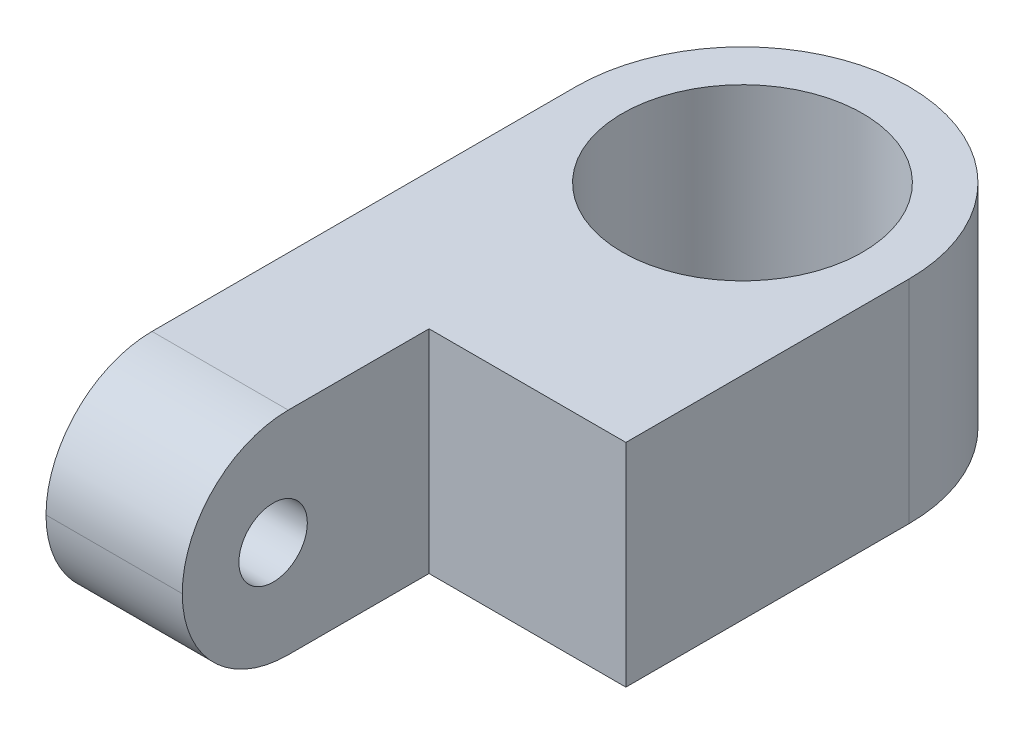
ISO-10303-21;
HEADER;
FILE_DESCRIPTION(('STEP AP214'),'2;1');
FILE_NAME('part.step','',(''),(''),'','','');
FILE_SCHEMA(('AUTOMOTIVE_DESIGN { 1 0 10303 214 1 1 1 1 }'));
ENDSEC;
DATA;
#1=APPLICATION_CONTEXT('core data for automotive mechanical design processes');
#2=APPLICATION_PROTOCOL_DEFINITION('international standard','automotive_design',2000,#1);
#3=PRODUCT_CONTEXT('',#1,'mechanical');
#4=PRODUCT('Part','Part','',(#3));
#5=PRODUCT_RELATED_PRODUCT_CATEGORY('part','',(#4));
#6=PRODUCT_DEFINITION_FORMATION('','',#4);
#7=PRODUCT_DEFINITION_CONTEXT('part definition',#1,'design');
#8=PRODUCT_DEFINITION('design','',#6,#7);
#9=PRODUCT_DEFINITION_SHAPE('','',#8);
#10=(LENGTH_UNIT() NAMED_UNIT(*) SI_UNIT(.MILLI.,.METRE.));
#11=(NAMED_UNIT(*) PLANE_ANGLE_UNIT() SI_UNIT($,.RADIAN.));
#12=(NAMED_UNIT(*) SI_UNIT($,.STERADIAN.) SOLID_ANGLE_UNIT());
#13=UNCERTAINTY_MEASURE_WITH_UNIT(LENGTH_MEASURE(1.E-05),#10,'distance_accuracy_value','');
#14=(GEOMETRIC_REPRESENTATION_CONTEXT(3) GLOBAL_UNCERTAINTY_ASSIGNED_CONTEXT((#13)) GLOBAL_UNIT_ASSIGNED_CONTEXT((#10,
#11,#12)) REPRESENTATION_CONTEXT('',''));
#15=CARTESIAN_POINT('',(0.,0.,0.));
#16=DIRECTION('',(0.,0.,1.));
#17=DIRECTION('',(1.,0.,0.));
#18=AXIS2_PLACEMENT_3D('',#15,#16,#17);
#19=CARTESIAN_POINT('',(5.5,-3.5,11.5));
#20=DIRECTION('',(0.,1.,0.));
#21=DIRECTION('',(0.,0.,1.));
#22=AXIS2_PLACEMENT_3D('',#19,#20,#21);
#23=PLANE('',#22);
#24=CARTESIAN_POINT('',(0.,-3.5,-6.));
#25=DIRECTION('',(0.,1.,0.));
#26=DIRECTION('',(0.,0.,1.));
#27=AXIS2_PLACEMENT_3D('',#24,#25,#26);
#28=CIRCLE('',#27,3.96875);
#29=CARTESIAN_POINT('',(0.,-3.5,-2.03125));
#30=VERTEX_POINT('',#29);
#31=EDGE_CURVE('E127',#30,#30,#28,.T.);
#32=ORIENTED_EDGE('',*,*,#31,.T.);
#33=EDGE_LOOP('',(#32));
#34=FACE_BOUND('',#33,.T.);
#35=DIRECTION('',(0.,0.,-1.));
#36=VECTOR('',#35,1.);
#37=CARTESIAN_POINT('',(-5.5,-3.5,11.5));
#38=LINE('',#37,#36);
#39=CARTESIAN_POINT('',(-5.5,-3.5,8.));
#40=VERTEX_POINT('',#39);
#41=CARTESIAN_POINT('',(-5.5,-3.5,-6.));
#42=VERTEX_POINT('',#41);
#43=EDGE_CURVE('E130',#40,#42,#38,.T.);
#44=ORIENTED_EDGE('',*,*,#43,.T.);
#45=CARTESIAN_POINT('',(0.,-3.5,-6.));
#46=DIRECTION('',(0.,1.,0.));
#47=DIRECTION('',(0.,0.,1.));
#48=AXIS2_PLACEMENT_3D('',#45,#46,#47);
#49=CIRCLE('',#48,5.5);
#50=CARTESIAN_POINT('',(0.,-3.5,-11.5));
#51=VERTEX_POINT('',#50);
#52=EDGE_CURVE('E44',#42,#51,#49,.F.);
#53=ORIENTED_EDGE('',*,*,#52,.T.);
#54=CARTESIAN_POINT('',(0.,-3.5,-6.));
#55=DIRECTION('',(0.,1.,0.));
#56=DIRECTION('',(0.,0.,1.));
#57=AXIS2_PLACEMENT_3D('',#54,#55,#56);
#58=CIRCLE('',#57,5.5);
#59=CARTESIAN_POINT('',(5.5,-3.5,-6.));
#60=VERTEX_POINT('',#59);
#61=EDGE_CURVE('E51',#51,#60,#58,.F.);
#62=ORIENTED_EDGE('',*,*,#61,.T.);
#63=DIRECTION('',(0.,0.,-1.));
#64=VECTOR('',#63,1.);
#65=CARTESIAN_POINT('',(5.5,-3.5,11.5));
#66=LINE('',#65,#64);
#67=CARTESIAN_POINT('',(5.5,-3.5,3.35));
#68=VERTEX_POINT('',#67);
#69=EDGE_CURVE('E120',#68,#60,#66,.T.);
#70=ORIENTED_EDGE('',*,*,#69,.F.);
#71=DIRECTION('',(1.,0.,0.));
#72=VECTOR('',#71,1.);
#73=CARTESIAN_POINT('',(-1.,-3.5,3.35));
#74=LINE('',#73,#72);
#75=CARTESIAN_POINT('',(-1.,-3.5,3.35));
#76=VERTEX_POINT('',#75);
#77=EDGE_CURVE('E114',#76,#68,#74,.T.);
#78=ORIENTED_EDGE('',*,*,#77,.F.);
#79=DIRECTION('',(0.,0.,-1.));
#80=VECTOR('',#79,1.);
#81=CARTESIAN_POINT('',(-1.,-3.5,11.5));
#82=LINE('',#81,#80);
#83=CARTESIAN_POINT('',(-1.,-3.5,8.));
#84=VERTEX_POINT('',#83);
#85=EDGE_CURVE('E98',#84,#76,#82,.T.);
#86=ORIENTED_EDGE('',*,*,#85,.F.);
#87=DIRECTION('',(-1.,0.,0.));
#88=VECTOR('',#87,1.);
#89=CARTESIAN_POINT('',(5.5,-3.5,8.));
#90=LINE('',#89,#88);
#91=EDGE_CURVE('E137',#84,#40,#90,.T.);
#92=ORIENTED_EDGE('',*,*,#91,.T.);
#93=EDGE_LOOP('',(#44,#53,#62,#70,#78,#86,#92));
#94=FACE_BOUND('',#93,.T.);
#95=ADVANCED_FACE('F35',(#34,#94),#23,.F.);
#96=CARTESIAN_POINT('',(5.5,3.5,11.5));
#97=DIRECTION('',(0.,-1.,0.));
#98=DIRECTION('',(0.,0.,-1.));
#99=AXIS2_PLACEMENT_3D('',#96,#97,#98);
#100=PLANE('',#99);
#101=CARTESIAN_POINT('',(0.,3.5,-6.));
#102=DIRECTION('',(0.,1.,0.));
#103=DIRECTION('',(0.,0.,1.));
#104=AXIS2_PLACEMENT_3D('',#101,#102,#103);
#105=CIRCLE('',#104,3.96875);
#106=CARTESIAN_POINT('',(0.,3.5,-2.03125));
#107=VERTEX_POINT('',#106);
#108=EDGE_CURVE('E122',#107,#107,#105,.T.);
#109=ORIENTED_EDGE('',*,*,#108,.F.);
#110=EDGE_LOOP('',(#109));
#111=FACE_BOUND('',#110,.T.);
#112=CARTESIAN_POINT('',(0.,3.5,-6.));
#113=DIRECTION('',(0.,-1.,0.));
#114=DIRECTION('',(0.,0.,-1.));
#115=AXIS2_PLACEMENT_3D('',#112,#113,#114);
#116=CIRCLE('',#115,5.5);
#117=CARTESIAN_POINT('',(5.5,3.5,-6.));
#118=VERTEX_POINT('',#117);
#119=CARTESIAN_POINT('',(0.,3.5,-11.5));
#120=VERTEX_POINT('',#119);
#121=EDGE_CURVE('E151',#118,#120,#116,.F.);
#122=ORIENTED_EDGE('',*,*,#121,.T.);
#123=CARTESIAN_POINT('',(0.,3.5,-6.));
#124=DIRECTION('',(0.,-1.,0.));
#125=DIRECTION('',(0.,0.,-1.));
#126=AXIS2_PLACEMENT_3D('',#123,#124,#125);
#127=CIRCLE('',#126,5.5);
#128=CARTESIAN_POINT('',(-5.5,3.5,-6.));
#129=VERTEX_POINT('',#128);
#130=EDGE_CURVE('E157',#120,#129,#127,.F.);
#131=ORIENTED_EDGE('',*,*,#130,.T.);
#132=DIRECTION('',(0.,0.,1.));
#133=VECTOR('',#132,1.);
#134=CARTESIAN_POINT('',(-5.5,3.5,11.5));
#135=LINE('',#134,#133);
#136=CARTESIAN_POINT('',(-5.5,3.5,8.));
#137=VERTEX_POINT('',#136);
#138=EDGE_CURVE('E135',#129,#137,#135,.T.);
#139=ORIENTED_EDGE('',*,*,#138,.T.);
#140=DIRECTION('',(-1.,0.,0.));
#141=VECTOR('',#140,1.);
#142=CARTESIAN_POINT('',(5.5,3.5,8.));
#143=LINE('',#142,#141);
#144=CARTESIAN_POINT('',(-1.,3.5,8.));
#145=VERTEX_POINT('',#144);
#146=EDGE_CURVE('E149',#137,#145,#143,.F.);
#147=ORIENTED_EDGE('',*,*,#146,.T.);
#148=DIRECTION('',(0.,0.,1.));
#149=VECTOR('',#148,1.);
#150=CARTESIAN_POINT('',(-1.,3.5,11.5));
#151=LINE('',#150,#149);
#152=CARTESIAN_POINT('',(-1.,3.5,3.35));
#153=VERTEX_POINT('',#152);
#154=EDGE_CURVE('E118',#153,#145,#151,.T.);
#155=ORIENTED_EDGE('',*,*,#154,.F.);
#156=DIRECTION('',(1.,0.,0.));
#157=VECTOR('',#156,1.);
#158=CARTESIAN_POINT('',(-1.,3.5,3.35));
#159=LINE('',#158,#157);
#160=CARTESIAN_POINT('',(5.5,3.5,3.35));
#161=VERTEX_POINT('',#160);
#162=EDGE_CURVE('E117',#153,#161,#159,.T.);
#163=ORIENTED_EDGE('',*,*,#162,.T.);
#164=DIRECTION('',(0.,0.,1.));
#165=VECTOR('',#164,1.);
#166=CARTESIAN_POINT('',(5.5,3.5,11.5));
#167=LINE('',#166,#165);
#168=EDGE_CURVE('E134',#118,#161,#167,.T.);
#169=ORIENTED_EDGE('',*,*,#168,.F.);
#170=EDGE_LOOP('',(#122,#131,#139,#147,#155,#163,#169));
#171=FACE_BOUND('',#170,.T.);
#172=ADVANCED_FACE('F179',(#111,#171),#100,.F.);
#173=CARTESIAN_POINT('',(5.5,0.,0.));
#174=DIRECTION('',(1.,0.,0.));
#175=DIRECTION('',(0.,0.,-1.));
#176=AXIS2_PLACEMENT_3D('',#173,#174,#175);
#177=PLANE('',#176);
#178=ORIENTED_EDGE('',*,*,#69,.T.);
#179=DIRECTION('',(0.,1.,0.));
#180=VECTOR('',#179,1.);
#181=CARTESIAN_POINT('',(5.5,3.5,-6.));
#182=LINE('',#181,#180);
#183=EDGE_CURVE('E11',#60,#118,#182,.T.);
#184=ORIENTED_EDGE('',*,*,#183,.T.);
#185=ORIENTED_EDGE('',*,*,#168,.T.);
#186=DIRECTION('',(0.,1.,0.));
#187=VECTOR('',#186,1.);
#188=CARTESIAN_POINT('',(5.5,3.5,3.35));
#189=LINE('',#188,#187);
#190=EDGE_CURVE('E109',#68,#161,#189,.T.);
#191=ORIENTED_EDGE('',*,*,#190,.F.);
#192=EDGE_LOOP('',(#178,#184,#185,#191));
#193=FACE_BOUND('',#192,.T.);
#194=ADVANCED_FACE('F188',(#193),#177,.T.);
#195=CARTESIAN_POINT('',(-5.5,0.,0.));
#196=DIRECTION('',(1.,0.,0.));
#197=DIRECTION('',(0.,0.,-1.));
#198=AXIS2_PLACEMENT_3D('',#195,#196,#197);
#199=PLANE('',#198);
#200=CARTESIAN_POINT('',(-5.5,-0.0399999999999984,8.5));
#201=DIRECTION('',(1.,0.,0.));
#202=DIRECTION('',(0.,0.,-1.));
#203=AXIS2_PLACEMENT_3D('',#200,#201,#202);
#204=CIRCLE('',#203,1.1303);
#205=CARTESIAN_POINT('',(-5.5,-0.0399999999999984,7.3697));
#206=VERTEX_POINT('',#205);
#207=EDGE_CURVE('E189',#206,#206,#204,.T.);
#208=ORIENTED_EDGE('',*,*,#207,.T.);
#209=EDGE_LOOP('',(#208));
#210=FACE_BOUND('',#209,.T.);
#211=ORIENTED_EDGE('',*,*,#138,.F.);
#212=DIRECTION('',(0.,1.,0.));
#213=VECTOR('',#212,1.);
#214=CARTESIAN_POINT('',(-5.5,0.,-6.));
#215=LINE('',#214,#213);
#216=EDGE_CURVE('E159',#129,#42,#215,.F.);
#217=ORIENTED_EDGE('',*,*,#216,.T.);
#218=ORIENTED_EDGE('',*,*,#43,.F.);
#219=CARTESIAN_POINT('',(-5.5,0.,8.));
#220=DIRECTION('',(1.,0.,0.));
#221=DIRECTION('',(0.,0.,-1.));
#222=AXIS2_PLACEMENT_3D('',#219,#220,#221);
#223=CIRCLE('',#222,3.5);
#224=CARTESIAN_POINT('',(-5.5,0.,11.5));
#225=VERTEX_POINT('',#224);
#226=EDGE_CURVE('E144',#40,#225,#223,.F.);
#227=ORIENTED_EDGE('',*,*,#226,.T.);
#228=CARTESIAN_POINT('',(-5.5,0.,8.));
#229=DIRECTION('',(1.,0.,0.));
#230=DIRECTION('',(0.,0.,-1.));
#231=AXIS2_PLACEMENT_3D('',#228,#229,#230);
#232=CIRCLE('',#231,3.5);
#233=EDGE_CURVE('E141',#225,#137,#232,.F.);
#234=ORIENTED_EDGE('',*,*,#233,.T.);
#235=EDGE_LOOP('',(#211,#217,#218,#227,#234));
#236=FACE_BOUND('',#235,.T.);
#237=ADVANCED_FACE('F167',(#210,#236),#199,.F.);
#238=CARTESIAN_POINT('',(0.,-3.5,-6.));
#239=DIRECTION('',(0.,1.,0.));
#240=DIRECTION('',(0.,0.,1.));
#241=AXIS2_PLACEMENT_3D('',#238,#239,#240);
#242=CYLINDRICAL_SURFACE('',#241,3.96875);
#243=ORIENTED_EDGE('',*,*,#31,.F.);
#244=EDGE_LOOP('',(#243));
#245=FACE_BOUND('',#244,.T.);
#246=ORIENTED_EDGE('',*,*,#108,.T.);
#247=EDGE_LOOP('',(#246));
#248=FACE_BOUND('',#247,.T.);
#249=ADVANCED_FACE('F206',(#245,#248),#242,.F.);
#250=CARTESIAN_POINT('',(-1.,3.5,3.35));
#251=DIRECTION('',(0.,0.,-1.));
#252=DIRECTION('',(-1.,0.,0.));
#253=AXIS2_PLACEMENT_3D('',#250,#251,#252);
#254=PLANE('',#253);
#255=ORIENTED_EDGE('',*,*,#190,.T.);
#256=ORIENTED_EDGE('',*,*,#162,.F.);
#257=DIRECTION('',(0.,1.,0.));
#258=VECTOR('',#257,1.);
#259=CARTESIAN_POINT('',(-1.,3.5,3.35));
#260=LINE('',#259,#258);
#261=EDGE_CURVE('E102',#76,#153,#260,.T.);
#262=ORIENTED_EDGE('',*,*,#261,.F.);
#263=ORIENTED_EDGE('',*,*,#77,.T.);
#264=EDGE_LOOP('',(#255,#256,#262,#263));
#265=FACE_BOUND('',#264,.T.);
#266=ADVANCED_FACE('F113',(#265),#254,.F.);
#267=CARTESIAN_POINT('',(-1.,0.,0.));
#268=DIRECTION('',(1.,0.,0.));
#269=DIRECTION('',(0.,0.,-1.));
#270=AXIS2_PLACEMENT_3D('',#267,#268,#269);
#271=PLANE('',#270);
#272=CARTESIAN_POINT('',(-1.,-0.0399999999999984,8.5));
#273=DIRECTION('',(1.,0.,0.));
#274=DIRECTION('',(0.,0.,-1.));
#275=AXIS2_PLACEMENT_3D('',#272,#273,#274);
#276=CIRCLE('',#275,1.1303);
#277=CARTESIAN_POINT('',(-1.,-0.0399999999999984,7.3697));
#278=VERTEX_POINT('',#277);
#279=EDGE_CURVE('E155',#278,#278,#276,.T.);
#280=ORIENTED_EDGE('',*,*,#279,.F.);
#281=EDGE_LOOP('',(#280));
#282=FACE_BOUND('',#281,.T.);
#283=CARTESIAN_POINT('',(-1.,0.,8.));
#284=DIRECTION('',(1.,0.,0.));
#285=DIRECTION('',(0.,0.,-1.));
#286=AXIS2_PLACEMENT_3D('',#283,#284,#285);
#287=CIRCLE('',#286,3.5);
#288=CARTESIAN_POINT('',(-1.,0.,11.5));
#289=VERTEX_POINT('',#288);
#290=EDGE_CURVE('E146',#145,#289,#287,.T.);
#291=ORIENTED_EDGE('',*,*,#290,.T.);
#292=CARTESIAN_POINT('',(-1.,0.,8.));
#293=DIRECTION('',(1.,0.,0.));
#294=DIRECTION('',(0.,0.,-1.));
#295=AXIS2_PLACEMENT_3D('',#292,#293,#294);
#296=CIRCLE('',#295,3.5);
#297=EDGE_CURVE('E105',#289,#84,#296,.T.);
#298=ORIENTED_EDGE('',*,*,#297,.T.);
#299=ORIENTED_EDGE('',*,*,#85,.T.);
#300=ORIENTED_EDGE('',*,*,#261,.T.);
#301=ORIENTED_EDGE('',*,*,#154,.T.);
#302=EDGE_LOOP('',(#291,#298,#299,#300,#301));
#303=FACE_BOUND('',#302,.T.);
#304=ADVANCED_FACE('F100',(#282,#303),#271,.T.);
#305=CARTESIAN_POINT('',(-1.,-0.0399999999999984,8.5));
#306=DIRECTION('',(1.,0.,0.));
#307=DIRECTION('',(0.,0.,-1.));
#308=AXIS2_PLACEMENT_3D('',#305,#306,#307);
#309=CYLINDRICAL_SURFACE('',#308,1.1303);
#310=ORIENTED_EDGE('',*,*,#207,.F.);
#311=EDGE_LOOP('',(#310));
#312=FACE_BOUND('',#311,.T.);
#313=ORIENTED_EDGE('',*,*,#279,.T.);
#314=EDGE_LOOP('',(#313));
#315=FACE_BOUND('',#314,.T.);
#316=ADVANCED_FACE('F196',(#312,#315),#309,.F.);
#317=CARTESIAN_POINT('',(5.5,0.,8.));
#318=DIRECTION('',(-1.,0.,0.));
#319=DIRECTION('',(0.,0.,1.));
#320=AXIS2_PLACEMENT_3D('',#317,#318,#319);
#321=CYLINDRICAL_SURFACE('',#320,3.5);
#322=DIRECTION('',(-1.,0.,0.));
#323=VECTOR('',#322,1.);
#324=CARTESIAN_POINT('',(5.5,0.,11.5));
#325=LINE('',#324,#323);
#326=EDGE_CURVE('E152',#289,#225,#325,.T.);
#327=ORIENTED_EDGE('',*,*,#326,.F.);
#328=ORIENTED_EDGE('',*,*,#290,.F.);
#329=ORIENTED_EDGE('',*,*,#146,.F.);
#330=ORIENTED_EDGE('',*,*,#233,.F.);
#331=EDGE_LOOP('',(#327,#328,#329,#330));
#332=FACE_BOUND('',#331,.T.);
#333=ADVANCED_FACE('F176',(#332),#321,.T.);
#334=CARTESIAN_POINT('',(5.5,0.,8.));
#335=DIRECTION('',(-1.,0.,0.));
#336=DIRECTION('',(0.,0.,1.));
#337=AXIS2_PLACEMENT_3D('',#334,#335,#336);
#338=CYLINDRICAL_SURFACE('',#337,3.5);
#339=ORIENTED_EDGE('',*,*,#297,.F.);
#340=ORIENTED_EDGE('',*,*,#326,.T.);
#341=ORIENTED_EDGE('',*,*,#226,.F.);
#342=ORIENTED_EDGE('',*,*,#91,.F.);
#343=EDGE_LOOP('',(#339,#340,#341,#342));
#344=FACE_BOUND('',#343,.T.);
#345=ADVANCED_FACE('F171',(#344),#338,.T.);
#346=CARTESIAN_POINT('',(0.,0.,-6.));
#347=DIRECTION('',(0.,-1.,0.));
#348=DIRECTION('',(0.,0.,-1.));
#349=AXIS2_PLACEMENT_3D('',#346,#347,#348);
#350=CYLINDRICAL_SURFACE('',#349,5.5);
#351=ORIENTED_EDGE('',*,*,#183,.F.);
#352=ORIENTED_EDGE('',*,*,#61,.F.);
#353=DIRECTION('',(0.,1.,0.));
#354=VECTOR('',#353,1.);
#355=CARTESIAN_POINT('',(0.,-3.5,-11.5));
#356=LINE('',#355,#354);
#357=EDGE_CURVE('E39',#120,#51,#356,.F.);
#358=ORIENTED_EDGE('',*,*,#357,.F.);
#359=ORIENTED_EDGE('',*,*,#121,.F.);
#360=EDGE_LOOP('',(#351,#352,#358,#359));
#361=FACE_BOUND('',#360,.T.);
#362=ADVANCED_FACE('F37',(#361),#350,.T.);
#363=CARTESIAN_POINT('',(0.,3.5,-6.));
#364=DIRECTION('',(0.,1.,0.));
#365=DIRECTION('',(0.,0.,1.));
#366=AXIS2_PLACEMENT_3D('',#363,#364,#365);
#367=CYLINDRICAL_SURFACE('',#366,5.5);
#368=ORIENTED_EDGE('',*,*,#52,.F.);
#369=ORIENTED_EDGE('',*,*,#216,.F.);
#370=ORIENTED_EDGE('',*,*,#130,.F.);
#371=ORIENTED_EDGE('',*,*,#357,.T.);
#372=EDGE_LOOP('',(#368,#369,#370,#371));
#373=FACE_BOUND('',#372,.T.);
#374=ADVANCED_FACE('F184',(#373),#367,.T.);
#375=CLOSED_SHELL('',(#95,#172,#194,#237,#249,#266,#304,#316,#333,#345,#362,#374));
#376=MANIFOLD_SOLID_BREP('B2',#375);
#377=ADVANCED_BREP_SHAPE_REPRESENTATION('',(#18,#376),#14);
#378=SHAPE_DEFINITION_REPRESENTATION(#9,#377);
ENDSEC;
END-ISO-10303-21;
